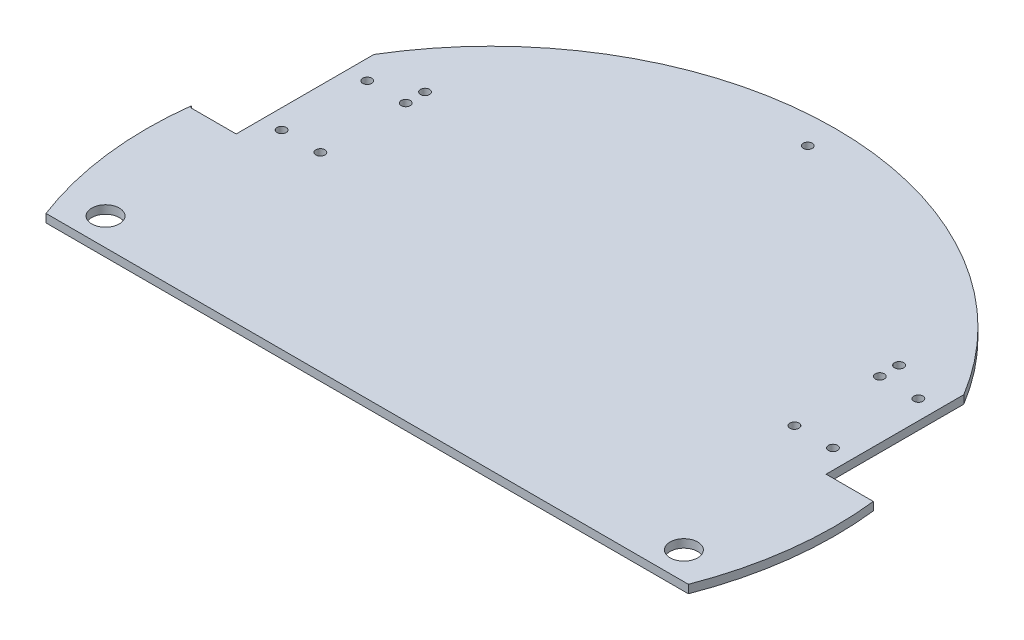
ISO-10303-21;
HEADER;
FILE_DESCRIPTION(('STEP AP214'),'2;1');
FILE_NAME('part.step','',(''),(''),'','','');
FILE_SCHEMA(('AUTOMOTIVE_DESIGN { 1 0 10303 214 1 1 1 1 }'));
ENDSEC;
DATA;
#1=APPLICATION_CONTEXT('core data for automotive mechanical design processes');
#2=APPLICATION_PROTOCOL_DEFINITION('international standard','automotive_design',2000,#1);
#3=PRODUCT_CONTEXT('',#1,'mechanical');
#4=PRODUCT('Part','Part','',(#3));
#5=PRODUCT_RELATED_PRODUCT_CATEGORY('part','',(#4));
#6=PRODUCT_DEFINITION_FORMATION('','',#4);
#7=PRODUCT_DEFINITION_CONTEXT('part definition',#1,'design');
#8=PRODUCT_DEFINITION('design','',#6,#7);
#9=PRODUCT_DEFINITION_SHAPE('','',#8);
#10=(LENGTH_UNIT() NAMED_UNIT(*) SI_UNIT(.MILLI.,.METRE.));
#11=(NAMED_UNIT(*) PLANE_ANGLE_UNIT() SI_UNIT($,.RADIAN.));
#12=(NAMED_UNIT(*) SI_UNIT($,.STERADIAN.) SOLID_ANGLE_UNIT());
#13=UNCERTAINTY_MEASURE_WITH_UNIT(LENGTH_MEASURE(1.E-05),#10,'distance_accuracy_value','');
#14=(GEOMETRIC_REPRESENTATION_CONTEXT(3) GLOBAL_UNCERTAINTY_ASSIGNED_CONTEXT((#13)) GLOBAL_UNIT_ASSIGNED_CONTEXT((#10,
#11,#12)) REPRESENTATION_CONTEXT('',''));
#15=CARTESIAN_POINT('',(0.,0.,0.));
#16=DIRECTION('',(0.,0.,1.));
#17=DIRECTION('',(1.,0.,0.));
#18=AXIS2_PLACEMENT_3D('',#15,#16,#17);
#19=CARTESIAN_POINT('',(-17.8076536899108,3.,0.854894606578442));
#20=DIRECTION('',(0.,-1.,0.));
#21=DIRECTION('',(0.,0.,-1.));
#22=AXIS2_PLACEMENT_3D('',#19,#20,#21);
#23=CYLINDRICAL_SURFACE('',#22,125.);
#24=CARTESIAN_POINT('',(-17.8076536899108,3.,0.854894606578442));
#25=DIRECTION('',(0.,1.,0.));
#26=DIRECTION('',(0.,0.,1.));
#27=AXIS2_PLACEMENT_3D('',#24,#25,#26);
#28=CIRCLE('',#27,125.);
#29=CARTESIAN_POINT('',(89.1923463100892,3.,-63.7670830790356));
#30=VERTEX_POINT('',#29);
#31=CARTESIAN_POINT('',(-124.881226526536,3.,-63.6451053934216));
#32=VERTEX_POINT('',#31);
#33=EDGE_CURVE('E41',#30,#32,#28,.T.);
#34=ORIENTED_EDGE('',*,*,#33,.F.);
#35=DIRECTION('',(0.,-1.,0.));
#36=VECTOR('',#35,1.);
#37=CARTESIAN_POINT('',(89.1923463100892,10.,-63.7670830790356));
#38=LINE('',#37,#36);
#39=CARTESIAN_POINT('',(89.1923463100892,0.,-63.7670830790356));
#40=VERTEX_POINT('',#39);
#41=EDGE_CURVE('E114',#30,#40,#38,.T.);
#42=ORIENTED_EDGE('',*,*,#41,.T.);
#43=CARTESIAN_POINT('',(-17.8076536899108,0.,0.854894606578442));
#44=DIRECTION('',(0.,1.,0.));
#45=DIRECTION('',(0.,0.,1.));
#46=AXIS2_PLACEMENT_3D('',#43,#44,#45);
#47=CIRCLE('',#46,125.);
#48=CARTESIAN_POINT('',(-124.881226526536,0.,-63.6451053934216));
#49=VERTEX_POINT('',#48);
#50=EDGE_CURVE('E57',#40,#49,#47,.T.);
#51=ORIENTED_EDGE('',*,*,#50,.T.);
#52=DIRECTION('',(0.,-1.,0.));
#53=VECTOR('',#52,1.);
#54=CARTESIAN_POINT('',(-124.881226526536,10.,-63.6451053934216));
#55=LINE('',#54,#53);
#56=EDGE_CURVE('E141',#32,#49,#55,.T.);
#57=ORIENTED_EDGE('',*,*,#56,.F.);
#58=EDGE_LOOP('',(#34,#42,#51,#57));
#59=FACE_BOUND('',#58,.T.);
#60=ADVANCED_FACE('F32',(#59),#23,.T.);
#61=CARTESIAN_POINT('',(-141.871934685686,3.,-14.4112175704417));
#62=VERTEX_POINT('',#61);
#63=CARTESIAN_POINT('',(-134.426691586817,3.,45.8548946065784));
#64=VERTEX_POINT('',#63);
#65=EDGE_CURVE('E42',#62,#64,#28,.T.);
#66=ORIENTED_EDGE('',*,*,#65,.F.);
#67=DIRECTION('',(0.,-1.,0.));
#68=VECTOR('',#67,1.);
#69=CARTESIAN_POINT('',(-141.871934685686,3.,-14.4112175704417));
#70=LINE('',#69,#68);
#71=CARTESIAN_POINT('',(-141.871934685686,0.,-14.4112175704417));
#72=VERTEX_POINT('',#71);
#73=EDGE_CURVE('E154',#62,#72,#70,.T.);
#74=ORIENTED_EDGE('',*,*,#73,.T.);
#75=CARTESIAN_POINT('',(-134.426691586817,0.,45.8548946065784));
#76=VERTEX_POINT('',#75);
#77=EDGE_CURVE('E226',#72,#76,#47,.T.);
#78=ORIENTED_EDGE('',*,*,#77,.T.);
#79=DIRECTION('',(0.,-1.,0.));
#80=VECTOR('',#79,1.);
#81=CARTESIAN_POINT('',(-134.426691586817,3.,45.8548946065784));
#82=LINE('',#81,#80);
#83=EDGE_CURVE('E221',#64,#76,#82,.T.);
#84=ORIENTED_EDGE('',*,*,#83,.F.);
#85=EDGE_LOOP('',(#66,#74,#78,#84));
#86=FACE_BOUND('',#85,.T.);
#87=ADVANCED_FACE('F238',(#86),#23,.T.);
#88=CARTESIAN_POINT('',(98.8113842069952,0.,45.8548946065784));
#89=VERTEX_POINT('',#88);
#90=CARTESIAN_POINT('',(106.334191666767,0.,-13.7670830790356));
#91=VERTEX_POINT('',#90);
#92=EDGE_CURVE('E36',#89,#91,#47,.T.);
#93=ORIENTED_EDGE('',*,*,#92,.T.);
#94=DIRECTION('',(0.,-1.,0.));
#95=VECTOR('',#94,1.);
#96=CARTESIAN_POINT('',(106.334191666767,10.,-13.7670830790356));
#97=LINE('',#96,#95);
#98=CARTESIAN_POINT('',(106.334191666767,3.,-13.7670830790356));
#99=VERTEX_POINT('',#98);
#100=EDGE_CURVE('E49',#99,#91,#97,.T.);
#101=ORIENTED_EDGE('',*,*,#100,.F.);
#102=CARTESIAN_POINT('',(98.8113842069952,3.,45.8548946065784));
#103=VERTEX_POINT('',#102);
#104=EDGE_CURVE('E11',#103,#99,#28,.T.);
#105=ORIENTED_EDGE('',*,*,#104,.F.);
#106=DIRECTION('',(0.,-1.,0.));
#107=VECTOR('',#106,1.);
#108=CARTESIAN_POINT('',(98.8113842069952,3.,45.8548946065784));
#109=LINE('',#108,#107);
#110=EDGE_CURVE('E223',#103,#89,#109,.T.);
#111=ORIENTED_EDGE('',*,*,#110,.T.);
#112=EDGE_LOOP('',(#93,#101,#105,#111));
#113=FACE_BOUND('',#112,.T.);
#114=ADVANCED_FACE('F34',(#113),#23,.T.);
#115=CARTESIAN_POINT('',(-17.8076536899108,3.,0.854894606578442));
#116=DIRECTION('',(0.,1.,0.));
#117=DIRECTION('',(0.,0.,1.));
#118=AXIS2_PLACEMENT_3D('',#115,#116,#117);
#119=PLANE('',#118);
#120=CARTESIAN_POINT('',(68.1923463100892,3.,-61.2670830790356));
#121=DIRECTION('',(0.,1.,0.));
#122=DIRECTION('',(0.,0.,1.));
#123=AXIS2_PLACEMENT_3D('',#120,#121,#122);
#124=CIRCLE('',#123,1.65);
#125=CARTESIAN_POINT('',(68.1923463100892,3.,-59.6170830790356));
#126=VERTEX_POINT('',#125);
#127=EDGE_CURVE('E473',#126,#126,#124,.T.);
#128=ORIENTED_EDGE('',*,*,#127,.F.);
#129=EDGE_LOOP('',(#128));
#130=FACE_BOUND('',#129,.T.);
#131=CARTESIAN_POINT('',(-17.3812265265356,3.,-113.706374405438));
#132=DIRECTION('',(0.,1.,0.));
#133=DIRECTION('',(0.,0.,1.));
#134=AXIS2_PLACEMENT_3D('',#131,#132,#133);
#135=CIRCLE('',#134,1.65);
#136=CARTESIAN_POINT('',(-17.3812265265356,3.,-112.056374405438));
#137=VERTEX_POINT('',#136);
#138=EDGE_CURVE('E483',#137,#137,#135,.T.);
#139=ORIENTED_EDGE('',*,*,#138,.F.);
#140=EDGE_LOOP('',(#139));
#141=FACE_BOUND('',#140,.T.);
#142=CARTESIAN_POINT('',(-103.807653689911,3.,-61.1451053934216));
#143=DIRECTION('',(0.,1.,0.));
#144=DIRECTION('',(0.,0.,1.));
#145=AXIS2_PLACEMENT_3D('',#142,#143,#144);
#146=CIRCLE('',#145,1.65);
#147=CARTESIAN_POINT('',(-103.807653689911,3.,-59.4951053934216));
#148=VERTEX_POINT('',#147);
#149=EDGE_CURVE('E121',#148,#148,#146,.T.);
#150=ORIENTED_EDGE('',*,*,#149,.F.);
#151=EDGE_LOOP('',(#150));
#152=FACE_BOUND('',#151,.T.);
#153=DIRECTION('',(0.,0.,1.));
#154=VECTOR('',#153,1.);
#155=CARTESIAN_POINT('',(89.1923463100892,3.,0.854894606578412));
#156=LINE('',#155,#154);
#157=CARTESIAN_POINT('',(89.1923463100892,3.,-13.7670830790356));
#158=VERTEX_POINT('',#157);
#159=EDGE_CURVE('E112',#30,#158,#156,.T.);
#160=ORIENTED_EDGE('',*,*,#159,.F.);
#161=ORIENTED_EDGE('',*,*,#33,.T.);
#162=DIRECTION('',(0.,0.,-1.));
#163=VECTOR('',#162,1.);
#164=CARTESIAN_POINT('',(-124.881226526536,3.,0.854894606578442));
#165=LINE('',#164,#163);
#166=CARTESIAN_POINT('',(-124.881226526536,3.,-13.6451053934216));
#167=VERTEX_POINT('',#166);
#168=EDGE_CURVE('E144',#167,#32,#165,.T.);
#169=ORIENTED_EDGE('',*,*,#168,.F.);
#170=DIRECTION('',(1.,0.,0.));
#171=VECTOR('',#170,1.);
#172=CARTESIAN_POINT('',(-17.8076536899108,3.,-13.6451053934216));
#173=LINE('',#172,#171);
#174=CARTESIAN_POINT('',(-141.357501756476,3.,-13.6451053934216));
#175=VERTEX_POINT('',#174);
#176=EDGE_CURVE('E150',#175,#167,#173,.T.);
#177=ORIENTED_EDGE('',*,*,#176,.F.);
#178=DIRECTION('',(0.557466547763257,0.,0.830199402628619));
#179=VECTOR('',#178,1.);
#180=CARTESIAN_POINT('',(-96.2513232418952,3.,53.5286516829715));
#181=LINE('',#180,#179);
#182=EDGE_CURVE('E152',#62,#175,#181,.T.);
#183=ORIENTED_EDGE('',*,*,#182,.F.);
#184=ORIENTED_EDGE('',*,*,#65,.T.);
#185=DIRECTION('',(1.,0.,0.));
#186=VECTOR('',#185,1.);
#187=CARTESIAN_POINT('',(0.,3.,45.8548946065784));
#188=LINE('',#187,#186);
#189=EDGE_CURVE('E218',#64,#103,#188,.T.);
#190=ORIENTED_EDGE('',*,*,#189,.T.);
#191=ORIENTED_EDGE('',*,*,#104,.T.);
#192=DIRECTION('',(1.,0.,0.));
#193=VECTOR('',#192,1.);
#194=CARTESIAN_POINT('',(-17.8076536899108,3.,-13.7670830790356));
#195=LINE('',#194,#193);
#196=EDGE_CURVE('E129',#158,#99,#195,.T.);
#197=ORIENTED_EDGE('',*,*,#196,.F.);
#198=EDGE_LOOP('',(#160,#161,#169,#177,#183,#184,#190,#191,#197));
#199=FACE_BOUND('',#198,.T.);
#200=CARTESIAN_POINT('',(87.1923463100892,3.,35.8548946065784));
#201=DIRECTION('',(0.,1.,0.));
#202=DIRECTION('',(0.,0.,1.));
#203=AXIS2_PLACEMENT_3D('',#200,#201,#202);
#204=CIRCLE('',#203,5.00000000000001);
#205=CARTESIAN_POINT('',(87.1923463100892,3.,40.8548946065784));
#206=VERTEX_POINT('',#205);
#207=EDGE_CURVE('E160',#206,#206,#204,.T.);
#208=ORIENTED_EDGE('',*,*,#207,.F.);
#209=EDGE_LOOP('',(#208));
#210=FACE_BOUND('',#209,.T.);
#211=CARTESIAN_POINT('',(-122.807653689911,3.,35.8548946065784));
#212=DIRECTION('',(0.,1.,0.));
#213=DIRECTION('',(0.,0.,1.));
#214=AXIS2_PLACEMENT_3D('',#211,#212,#213);
#215=CIRCLE('',#214,5.00000000000001);
#216=CARTESIAN_POINT('',(-122.807653689911,3.,40.8548946065784));
#217=VERTEX_POINT('',#216);
#218=EDGE_CURVE('E166',#217,#217,#215,.T.);
#219=ORIENTED_EDGE('',*,*,#218,.F.);
#220=EDGE_LOOP('',(#219));
#221=FACE_BOUND('',#220,.T.);
#222=CARTESIAN_POINT('',(68.1923463100892,3.,-23.2670830790356));
#223=DIRECTION('',(0.,1.,0.));
#224=DIRECTION('',(0.,0.,1.));
#225=AXIS2_PLACEMENT_3D('',#222,#223,#224);
#226=CIRCLE('',#225,1.65);
#227=CARTESIAN_POINT('',(68.1923463100892,3.,-21.6170830790356));
#228=VERTEX_POINT('',#227);
#229=EDGE_CURVE('E172',#228,#228,#226,.T.);
#230=ORIENTED_EDGE('',*,*,#229,.F.);
#231=EDGE_LOOP('',(#230));
#232=FACE_BOUND('',#231,.T.);
#233=CARTESIAN_POINT('',(82.1923463100892,3.,-23.2670830790356));
#234=DIRECTION('',(0.,1.,0.));
#235=DIRECTION('',(0.,0.,1.));
#236=AXIS2_PLACEMENT_3D('',#233,#234,#235);
#237=CIRCLE('',#236,1.65);
#238=CARTESIAN_POINT('',(82.1923463100892,3.,-21.6170830790356));
#239=VERTEX_POINT('',#238);
#240=EDGE_CURVE('E178',#239,#239,#237,.T.);
#241=ORIENTED_EDGE('',*,*,#240,.F.);
#242=EDGE_LOOP('',(#241));
#243=FACE_BOUND('',#242,.T.);
#244=CARTESIAN_POINT('',(82.1923463100892,3.,-54.2670830790356));
#245=DIRECTION('',(0.,1.,0.));
#246=DIRECTION('',(0.,0.,1.));
#247=AXIS2_PLACEMENT_3D('',#244,#245,#246);
#248=CIRCLE('',#247,1.65);
#249=CARTESIAN_POINT('',(82.1923463100892,3.,-52.6170830790356));
#250=VERTEX_POINT('',#249);
#251=EDGE_CURVE('E184',#250,#250,#248,.T.);
#252=ORIENTED_EDGE('',*,*,#251,.F.);
#253=EDGE_LOOP('',(#252));
#254=FACE_BOUND('',#253,.T.);
#255=CARTESIAN_POINT('',(68.1923463100892,3.,-54.2670830790356));
#256=DIRECTION('',(0.,1.,0.));
#257=DIRECTION('',(0.,0.,1.));
#258=AXIS2_PLACEMENT_3D('',#255,#256,#257);
#259=CIRCLE('',#258,1.65);
#260=CARTESIAN_POINT('',(68.1923463100892,3.,-52.6170830790356));
#261=VERTEX_POINT('',#260);
#262=EDGE_CURVE('E190',#261,#261,#259,.T.);
#263=ORIENTED_EDGE('',*,*,#262,.F.);
#264=EDGE_LOOP('',(#263));
#265=FACE_BOUND('',#264,.T.);
#266=CARTESIAN_POINT('',(-103.807653689911,3.,-23.1451053934216));
#267=DIRECTION('',(0.,1.,0.));
#268=DIRECTION('',(0.,0.,1.));
#269=AXIS2_PLACEMENT_3D('',#266,#267,#268);
#270=CIRCLE('',#269,1.65);
#271=CARTESIAN_POINT('',(-103.807653689911,3.,-21.4951053934216));
#272=VERTEX_POINT('',#271);
#273=EDGE_CURVE('E196',#272,#272,#270,.T.);
#274=ORIENTED_EDGE('',*,*,#273,.F.);
#275=EDGE_LOOP('',(#274));
#276=FACE_BOUND('',#275,.T.);
#277=CARTESIAN_POINT('',(-103.807653689911,3.,-54.1451053934216));
#278=DIRECTION('',(0.,1.,0.));
#279=DIRECTION('',(0.,0.,1.));
#280=AXIS2_PLACEMENT_3D('',#277,#278,#279);
#281=CIRCLE('',#280,1.65);
#282=CARTESIAN_POINT('',(-103.807653689911,3.,-52.4951053934216));
#283=VERTEX_POINT('',#282);
#284=EDGE_CURVE('E202',#283,#283,#281,.T.);
#285=ORIENTED_EDGE('',*,*,#284,.F.);
#286=EDGE_LOOP('',(#285));
#287=FACE_BOUND('',#286,.T.);
#288=CARTESIAN_POINT('',(-117.881226526536,3.,-23.1451926993879));
#289=DIRECTION('',(0.,1.,0.));
#290=DIRECTION('',(0.,0.,1.));
#291=AXIS2_PLACEMENT_3D('',#288,#289,#290);
#292=CIRCLE('',#291,1.65);
#293=CARTESIAN_POINT('',(-117.881226526536,3.,-21.4951926993879));
#294=VERTEX_POINT('',#293);
#295=EDGE_CURVE('E208',#294,#294,#292,.T.);
#296=ORIENTED_EDGE('',*,*,#295,.F.);
#297=EDGE_LOOP('',(#296));
#298=FACE_BOUND('',#297,.T.);
#299=CARTESIAN_POINT('',(-117.807653689911,3.,-54.1451053934216));
#300=DIRECTION('',(0.,1.,0.));
#301=DIRECTION('',(0.,0.,1.));
#302=AXIS2_PLACEMENT_3D('',#299,#300,#301);
#303=CIRCLE('',#302,1.65);
#304=CARTESIAN_POINT('',(-117.807653689911,3.,-52.4951053934216));
#305=VERTEX_POINT('',#304);
#306=EDGE_CURVE('E214',#305,#305,#303,.T.);
#307=ORIENTED_EDGE('',*,*,#306,.F.);
#308=EDGE_LOOP('',(#307));
#309=FACE_BOUND('',#308,.T.);
#310=ADVANCED_FACE('F245',(#130,#141,#152,#199,#210,#221,#232,#243,#254,#265,#276,#287,#298,
#309),#119,.T.);
#311=CARTESIAN_POINT('',(-17.8076536899108,0.,0.854894606578442));
#312=DIRECTION('',(0.,1.,0.));
#313=DIRECTION('',(0.,0.,1.));
#314=AXIS2_PLACEMENT_3D('',#311,#312,#313);
#315=PLANE('',#314);
#316=CARTESIAN_POINT('',(68.1923463100892,0.,-61.2670830790356));
#317=DIRECTION('',(0.,-1.,0.));
#318=DIRECTION('',(0.,0.,-1.));
#319=AXIS2_PLACEMENT_3D('',#316,#317,#318);
#320=CIRCLE('',#319,1.65);
#321=CARTESIAN_POINT('',(68.1923463100892,0.,-62.9170830790356));
#322=VERTEX_POINT('',#321);
#323=EDGE_CURVE('E476',#322,#322,#320,.T.);
#324=ORIENTED_EDGE('',*,*,#323,.F.);
#325=EDGE_LOOP('',(#324));
#326=FACE_BOUND('',#325,.T.);
#327=CARTESIAN_POINT('',(-17.3812265265356,0.,-113.706374405438));
#328=DIRECTION('',(0.,-1.,0.));
#329=DIRECTION('',(0.,0.,-1.));
#330=AXIS2_PLACEMENT_3D('',#327,#328,#329);
#331=CIRCLE('',#330,1.65);
#332=CARTESIAN_POINT('',(-17.3812265265356,0.,-115.356374405438));
#333=VERTEX_POINT('',#332);
#334=EDGE_CURVE('E478',#333,#333,#331,.T.);
#335=ORIENTED_EDGE('',*,*,#334,.F.);
#336=EDGE_LOOP('',(#335));
#337=FACE_BOUND('',#336,.T.);
#338=CARTESIAN_POINT('',(-103.807653689911,0.,-61.1451053934216));
#339=DIRECTION('',(0.,-1.,0.));
#340=DIRECTION('',(0.,0.,-1.));
#341=AXIS2_PLACEMENT_3D('',#338,#339,#340);
#342=CIRCLE('',#341,1.65);
#343=CARTESIAN_POINT('',(-103.807653689911,0.,-62.7951053934216));
#344=VERTEX_POINT('',#343);
#345=EDGE_CURVE('E486',#344,#344,#342,.T.);
#346=ORIENTED_EDGE('',*,*,#345,.F.);
#347=EDGE_LOOP('',(#346));
#348=FACE_BOUND('',#347,.T.);
#349=CARTESIAN_POINT('',(87.1923463100892,0.,35.8548946065784));
#350=DIRECTION('',(0.,-1.,0.));
#351=DIRECTION('',(0.,0.,-1.));
#352=AXIS2_PLACEMENT_3D('',#349,#350,#351);
#353=CIRCLE('',#352,5.00000000000001);
#354=CARTESIAN_POINT('',(87.1923463100892,0.,30.8548946065784));
#355=VERTEX_POINT('',#354);
#356=EDGE_CURVE('E157',#355,#355,#353,.T.);
#357=ORIENTED_EDGE('',*,*,#356,.F.);
#358=EDGE_LOOP('',(#357));
#359=FACE_BOUND('',#358,.T.);
#360=CARTESIAN_POINT('',(-122.807653689911,0.,35.8548946065784));
#361=DIRECTION('',(0.,-1.,0.));
#362=DIRECTION('',(0.,0.,-1.));
#363=AXIS2_PLACEMENT_3D('',#360,#361,#362);
#364=CIRCLE('',#363,5.00000000000001);
#365=CARTESIAN_POINT('',(-122.807653689911,0.,30.8548946065784));
#366=VERTEX_POINT('',#365);
#367=EDGE_CURVE('E163',#366,#366,#364,.T.);
#368=ORIENTED_EDGE('',*,*,#367,.F.);
#369=EDGE_LOOP('',(#368));
#370=FACE_BOUND('',#369,.T.);
#371=CARTESIAN_POINT('',(68.1923463100892,0.,-23.2670830790356));
#372=DIRECTION('',(0.,-1.,0.));
#373=DIRECTION('',(0.,0.,-1.));
#374=AXIS2_PLACEMENT_3D('',#371,#372,#373);
#375=CIRCLE('',#374,1.65);
#376=CARTESIAN_POINT('',(68.1923463100892,0.,-24.9170830790356));
#377=VERTEX_POINT('',#376);
#378=EDGE_CURVE('E169',#377,#377,#375,.T.);
#379=ORIENTED_EDGE('',*,*,#378,.F.);
#380=EDGE_LOOP('',(#379));
#381=FACE_BOUND('',#380,.T.);
#382=CARTESIAN_POINT('',(82.1923463100892,0.,-23.2670830790356));
#383=DIRECTION('',(0.,-1.,0.));
#384=DIRECTION('',(0.,0.,-1.));
#385=AXIS2_PLACEMENT_3D('',#382,#383,#384);
#386=CIRCLE('',#385,1.65);
#387=CARTESIAN_POINT('',(82.1923463100892,0.,-24.9170830790356));
#388=VERTEX_POINT('',#387);
#389=EDGE_CURVE('E175',#388,#388,#386,.T.);
#390=ORIENTED_EDGE('',*,*,#389,.F.);
#391=EDGE_LOOP('',(#390));
#392=FACE_BOUND('',#391,.T.);
#393=CARTESIAN_POINT('',(82.1923463100892,0.,-54.2670830790356));
#394=DIRECTION('',(0.,-1.,0.));
#395=DIRECTION('',(0.,0.,-1.));
#396=AXIS2_PLACEMENT_3D('',#393,#394,#395);
#397=CIRCLE('',#396,1.65);
#398=CARTESIAN_POINT('',(82.1923463100892,0.,-55.9170830790356));
#399=VERTEX_POINT('',#398);
#400=EDGE_CURVE('E181',#399,#399,#397,.T.);
#401=ORIENTED_EDGE('',*,*,#400,.F.);
#402=EDGE_LOOP('',(#401));
#403=FACE_BOUND('',#402,.T.);
#404=CARTESIAN_POINT('',(68.1923463100892,0.,-54.2670830790356));
#405=DIRECTION('',(0.,-1.,0.));
#406=DIRECTION('',(0.,0.,-1.));
#407=AXIS2_PLACEMENT_3D('',#404,#405,#406);
#408=CIRCLE('',#407,1.65);
#409=CARTESIAN_POINT('',(68.1923463100892,0.,-55.9170830790356));
#410=VERTEX_POINT('',#409);
#411=EDGE_CURVE('E187',#410,#410,#408,.T.);
#412=ORIENTED_EDGE('',*,*,#411,.F.);
#413=EDGE_LOOP('',(#412));
#414=FACE_BOUND('',#413,.T.);
#415=CARTESIAN_POINT('',(-103.807653689911,0.,-23.1451053934216));
#416=DIRECTION('',(0.,-1.,0.));
#417=DIRECTION('',(0.,0.,-1.));
#418=AXIS2_PLACEMENT_3D('',#415,#416,#417);
#419=CIRCLE('',#418,1.65);
#420=CARTESIAN_POINT('',(-103.807653689911,0.,-24.7951053934216));
#421=VERTEX_POINT('',#420);
#422=EDGE_CURVE('E193',#421,#421,#419,.T.);
#423=ORIENTED_EDGE('',*,*,#422,.F.);
#424=EDGE_LOOP('',(#423));
#425=FACE_BOUND('',#424,.T.);
#426=CARTESIAN_POINT('',(-103.807653689911,0.,-54.1451053934216));
#427=DIRECTION('',(0.,-1.,0.));
#428=DIRECTION('',(0.,0.,-1.));
#429=AXIS2_PLACEMENT_3D('',#426,#427,#428);
#430=CIRCLE('',#429,1.65);
#431=CARTESIAN_POINT('',(-103.807653689911,0.,-55.7951053934216));
#432=VERTEX_POINT('',#431);
#433=EDGE_CURVE('E199',#432,#432,#430,.T.);
#434=ORIENTED_EDGE('',*,*,#433,.F.);
#435=EDGE_LOOP('',(#434));
#436=FACE_BOUND('',#435,.T.);
#437=CARTESIAN_POINT('',(-117.881226526536,0.,-23.1451926993879));
#438=DIRECTION('',(0.,-1.,0.));
#439=DIRECTION('',(0.,0.,-1.));
#440=AXIS2_PLACEMENT_3D('',#437,#438,#439);
#441=CIRCLE('',#440,1.65);
#442=CARTESIAN_POINT('',(-117.881226526536,0.,-24.7951926993879));
#443=VERTEX_POINT('',#442);
#444=EDGE_CURVE('E205',#443,#443,#441,.T.);
#445=ORIENTED_EDGE('',*,*,#444,.F.);
#446=EDGE_LOOP('',(#445));
#447=FACE_BOUND('',#446,.T.);
#448=CARTESIAN_POINT('',(-117.807653689911,0.,-54.1451053934216));
#449=DIRECTION('',(0.,-1.,0.));
#450=DIRECTION('',(0.,0.,-1.));
#451=AXIS2_PLACEMENT_3D('',#448,#449,#450);
#452=CIRCLE('',#451,1.65);
#453=CARTESIAN_POINT('',(-117.807653689911,0.,-55.7951053934216));
#454=VERTEX_POINT('',#453);
#455=EDGE_CURVE('E211',#454,#454,#452,.T.);
#456=ORIENTED_EDGE('',*,*,#455,.F.);
#457=EDGE_LOOP('',(#456));
#458=FACE_BOUND('',#457,.T.);
#459=ORIENTED_EDGE('',*,*,#50,.F.);
#460=DIRECTION('',(0.,0.,-1.));
#461=VECTOR('',#460,1.);
#462=CARTESIAN_POINT('',(89.1923463100892,0.,-63.7670830790356));
#463=LINE('',#462,#461);
#464=CARTESIAN_POINT('',(89.1923463100892,0.,-13.7670830790356));
#465=VERTEX_POINT('',#464);
#466=EDGE_CURVE('E110',#465,#40,#463,.T.);
#467=ORIENTED_EDGE('',*,*,#466,.F.);
#468=DIRECTION('',(-1.,0.,0.));
#469=VECTOR('',#468,1.);
#470=CARTESIAN_POINT('',(89.1923463100892,0.,-13.7670830790356));
#471=LINE('',#470,#469);
#472=EDGE_CURVE('E116',#91,#465,#471,.T.);
#473=ORIENTED_EDGE('',*,*,#472,.F.);
#474=ORIENTED_EDGE('',*,*,#92,.F.);
#475=DIRECTION('',(1.,0.,0.));
#476=VECTOR('',#475,1.);
#477=CARTESIAN_POINT('',(0.,0.,45.8548946065784));
#478=LINE('',#477,#476);
#479=EDGE_CURVE('E217',#76,#89,#478,.T.);
#480=ORIENTED_EDGE('',*,*,#479,.F.);
#481=ORIENTED_EDGE('',*,*,#77,.F.);
#482=DIRECTION('',(-0.557466547763257,0.,-0.830199402628619));
#483=VECTOR('',#482,1.);
#484=CARTESIAN_POINT('',(-141.357501756476,0.,-13.6451053934216));
#485=LINE('',#484,#483);
#486=CARTESIAN_POINT('',(-141.357501756476,0.,-13.6451053934216));
#487=VERTEX_POINT('',#486);
#488=EDGE_CURVE('E139',#487,#72,#485,.T.);
#489=ORIENTED_EDGE('',*,*,#488,.F.);
#490=DIRECTION('',(-1.,0.,0.));
#491=VECTOR('',#490,1.);
#492=CARTESIAN_POINT('',(-124.881226526536,0.,-13.6451053934216));
#493=LINE('',#492,#491);
#494=CARTESIAN_POINT('',(-124.881226526536,0.,-13.6451053934216));
#495=VERTEX_POINT('',#494);
#496=EDGE_CURVE('E136',#495,#487,#493,.T.);
#497=ORIENTED_EDGE('',*,*,#496,.F.);
#498=DIRECTION('',(0.,0.,1.));
#499=VECTOR('',#498,1.);
#500=CARTESIAN_POINT('',(-124.881226526536,0.,-63.6451053934216));
#501=LINE('',#500,#499);
#502=EDGE_CURVE('E133',#49,#495,#501,.T.);
#503=ORIENTED_EDGE('',*,*,#502,.F.);
#504=EDGE_LOOP('',(#459,#467,#473,#474,#480,#481,#489,#497,#503));
#505=FACE_BOUND('',#504,.T.);
#506=ADVANCED_FACE('F123',(#326,#337,#348,#359,#370,#381,#392,#403,#414,#425,#436,#447,#458,
#505),#315,.F.);
#507=CARTESIAN_POINT('',(0.,3.,45.8548946065784));
#508=DIRECTION('',(0.,0.,-1.));
#509=DIRECTION('',(-1.,0.,0.));
#510=AXIS2_PLACEMENT_3D('',#507,#508,#509);
#511=PLANE('',#510);
#512=ORIENTED_EDGE('',*,*,#479,.T.);
#513=ORIENTED_EDGE('',*,*,#110,.F.);
#514=ORIENTED_EDGE('',*,*,#189,.F.);
#515=ORIENTED_EDGE('',*,*,#83,.T.);
#516=EDGE_LOOP('',(#512,#513,#514,#515));
#517=FACE_BOUND('',#516,.T.);
#518=ADVANCED_FACE('F232',(#517),#511,.F.);
#519=CARTESIAN_POINT('',(-117.807653689911,10.,-54.1451053934216));
#520=DIRECTION('',(0.,-1.,0.));
#521=DIRECTION('',(0.,0.,-1.));
#522=AXIS2_PLACEMENT_3D('',#519,#520,#521);
#523=CYLINDRICAL_SURFACE('',#522,1.65);
#524=ORIENTED_EDGE('',*,*,#306,.T.);
#525=EDGE_LOOP('',(#524));
#526=FACE_BOUND('',#525,.T.);
#527=ORIENTED_EDGE('',*,*,#455,.T.);
#528=EDGE_LOOP('',(#527));
#529=FACE_BOUND('',#528,.T.);
#530=ADVANCED_FACE('F282',(#526,#529),#523,.F.);
#531=CARTESIAN_POINT('',(-117.881226526536,10.,-23.1451926993879));
#532=DIRECTION('',(0.,-1.,0.));
#533=DIRECTION('',(0.,0.,-1.));
#534=AXIS2_PLACEMENT_3D('',#531,#532,#533);
#535=CYLINDRICAL_SURFACE('',#534,1.65);
#536=ORIENTED_EDGE('',*,*,#295,.T.);
#537=EDGE_LOOP('',(#536));
#538=FACE_BOUND('',#537,.T.);
#539=ORIENTED_EDGE('',*,*,#444,.T.);
#540=EDGE_LOOP('',(#539));
#541=FACE_BOUND('',#540,.T.);
#542=ADVANCED_FACE('F287',(#538,#541),#535,.F.);
#543=CARTESIAN_POINT('',(-103.807653689911,10.,-54.1451053934216));
#544=DIRECTION('',(0.,-1.,0.));
#545=DIRECTION('',(0.,0.,-1.));
#546=AXIS2_PLACEMENT_3D('',#543,#544,#545);
#547=CYLINDRICAL_SURFACE('',#546,1.65);
#548=ORIENTED_EDGE('',*,*,#284,.T.);
#549=EDGE_LOOP('',(#548));
#550=FACE_BOUND('',#549,.T.);
#551=ORIENTED_EDGE('',*,*,#433,.T.);
#552=EDGE_LOOP('',(#551));
#553=FACE_BOUND('',#552,.T.);
#554=ADVANCED_FACE('F298',(#550,#553),#547,.F.);
#555=CARTESIAN_POINT('',(-103.807653689911,10.,-23.1451053934216));
#556=DIRECTION('',(0.,-1.,0.));
#557=DIRECTION('',(0.,0.,-1.));
#558=AXIS2_PLACEMENT_3D('',#555,#556,#557);
#559=CYLINDRICAL_SURFACE('',#558,1.65);
#560=ORIENTED_EDGE('',*,*,#273,.T.);
#561=EDGE_LOOP('',(#560));
#562=FACE_BOUND('',#561,.T.);
#563=ORIENTED_EDGE('',*,*,#422,.T.);
#564=EDGE_LOOP('',(#563));
#565=FACE_BOUND('',#564,.T.);
#566=ADVANCED_FACE('F308',(#562,#565),#559,.F.);
#567=CARTESIAN_POINT('',(68.1923463100892,10.,-54.2670830790356));
#568=DIRECTION('',(0.,-1.,0.));
#569=DIRECTION('',(0.,0.,-1.));
#570=AXIS2_PLACEMENT_3D('',#567,#568,#569);
#571=CYLINDRICAL_SURFACE('',#570,1.65);
#572=ORIENTED_EDGE('',*,*,#262,.T.);
#573=EDGE_LOOP('',(#572));
#574=FACE_BOUND('',#573,.T.);
#575=ORIENTED_EDGE('',*,*,#411,.T.);
#576=EDGE_LOOP('',(#575));
#577=FACE_BOUND('',#576,.T.);
#578=ADVANCED_FACE('F318',(#574,#577),#571,.F.);
#579=CARTESIAN_POINT('',(82.1923463100892,10.,-54.2670830790356));
#580=DIRECTION('',(0.,-1.,0.));
#581=DIRECTION('',(0.,0.,-1.));
#582=AXIS2_PLACEMENT_3D('',#579,#580,#581);
#583=CYLINDRICAL_SURFACE('',#582,1.65);
#584=ORIENTED_EDGE('',*,*,#251,.T.);
#585=EDGE_LOOP('',(#584));
#586=FACE_BOUND('',#585,.T.);
#587=ORIENTED_EDGE('',*,*,#400,.T.);
#588=EDGE_LOOP('',(#587));
#589=FACE_BOUND('',#588,.T.);
#590=ADVANCED_FACE('F328',(#586,#589),#583,.F.);
#591=CARTESIAN_POINT('',(82.1923463100892,10.,-23.2670830790356));
#592=DIRECTION('',(0.,-1.,0.));
#593=DIRECTION('',(0.,0.,-1.));
#594=AXIS2_PLACEMENT_3D('',#591,#592,#593);
#595=CYLINDRICAL_SURFACE('',#594,1.65);
#596=ORIENTED_EDGE('',*,*,#240,.T.);
#597=EDGE_LOOP('',(#596));
#598=FACE_BOUND('',#597,.T.);
#599=ORIENTED_EDGE('',*,*,#389,.T.);
#600=EDGE_LOOP('',(#599));
#601=FACE_BOUND('',#600,.T.);
#602=ADVANCED_FACE('F338',(#598,#601),#595,.F.);
#603=CARTESIAN_POINT('',(68.1923463100892,10.,-23.2670830790356));
#604=DIRECTION('',(0.,-1.,0.));
#605=DIRECTION('',(0.,0.,-1.));
#606=AXIS2_PLACEMENT_3D('',#603,#604,#605);
#607=CYLINDRICAL_SURFACE('',#606,1.65);
#608=ORIENTED_EDGE('',*,*,#229,.T.);
#609=EDGE_LOOP('',(#608));
#610=FACE_BOUND('',#609,.T.);
#611=ORIENTED_EDGE('',*,*,#378,.T.);
#612=EDGE_LOOP('',(#611));
#613=FACE_BOUND('',#612,.T.);
#614=ADVANCED_FACE('F348',(#610,#613),#607,.F.);
#615=CARTESIAN_POINT('',(-122.807653689911,10.,35.8548946065784));
#616=DIRECTION('',(0.,-1.,0.));
#617=DIRECTION('',(0.,0.,-1.));
#618=AXIS2_PLACEMENT_3D('',#615,#616,#617);
#619=CYLINDRICAL_SURFACE('',#618,5.00000000000001);
#620=ORIENTED_EDGE('',*,*,#218,.T.);
#621=EDGE_LOOP('',(#620));
#622=FACE_BOUND('',#621,.T.);
#623=ORIENTED_EDGE('',*,*,#367,.T.);
#624=EDGE_LOOP('',(#623));
#625=FACE_BOUND('',#624,.T.);
#626=ADVANCED_FACE('F358',(#622,#625),#619,.F.);
#627=CARTESIAN_POINT('',(87.1923463100892,10.,35.8548946065784));
#628=DIRECTION('',(0.,-1.,0.));
#629=DIRECTION('',(0.,0.,-1.));
#630=AXIS2_PLACEMENT_3D('',#627,#628,#629);
#631=CYLINDRICAL_SURFACE('',#630,5.00000000000001);
#632=ORIENTED_EDGE('',*,*,#207,.T.);
#633=EDGE_LOOP('',(#632));
#634=FACE_BOUND('',#633,.T.);
#635=ORIENTED_EDGE('',*,*,#356,.T.);
#636=EDGE_LOOP('',(#635));
#637=FACE_BOUND('',#636,.T.);
#638=ADVANCED_FACE('F368',(#634,#637),#631,.F.);
#639=CARTESIAN_POINT('',(-141.357501756476,10.,-13.6451053934216));
#640=DIRECTION('',(-0.830199402628619,0.,0.557466547763257));
#641=DIRECTION('',(0.557466547763257,0.,0.830199402628619));
#642=AXIS2_PLACEMENT_3D('',#639,#640,#641);
#643=PLANE('',#642);
#644=ORIENTED_EDGE('',*,*,#182,.T.);
#645=DIRECTION('',(0.,-1.,0.));
#646=VECTOR('',#645,1.);
#647=CARTESIAN_POINT('',(-141.357501756476,10.,-13.6451053934216));
#648=LINE('',#647,#646);
#649=EDGE_CURVE('E142',#175,#487,#648,.T.);
#650=ORIENTED_EDGE('',*,*,#649,.T.);
#651=ORIENTED_EDGE('',*,*,#488,.T.);
#652=ORIENTED_EDGE('',*,*,#73,.F.);
#653=EDGE_LOOP('',(#644,#650,#651,#652));
#654=FACE_BOUND('',#653,.T.);
#655=ADVANCED_FACE('F241',(#654),#643,.F.);
#656=CARTESIAN_POINT('',(-124.881226526536,10.,-13.6451053934216));
#657=DIRECTION('',(0.,0.,1.));
#658=DIRECTION('',(1.,0.,0.));
#659=AXIS2_PLACEMENT_3D('',#656,#657,#658);
#660=PLANE('',#659);
#661=ORIENTED_EDGE('',*,*,#176,.T.);
#662=DIRECTION('',(0.,-1.,0.));
#663=VECTOR('',#662,1.);
#664=CARTESIAN_POINT('',(-124.881226526536,10.,-13.6451053934216));
#665=LINE('',#664,#663);
#666=EDGE_CURVE('E145',#167,#495,#665,.T.);
#667=ORIENTED_EDGE('',*,*,#666,.T.);
#668=ORIENTED_EDGE('',*,*,#496,.T.);
#669=ORIENTED_EDGE('',*,*,#649,.F.);
#670=EDGE_LOOP('',(#661,#667,#668,#669));
#671=FACE_BOUND('',#670,.T.);
#672=ADVANCED_FACE('F250',(#671),#660,.F.);
#673=CARTESIAN_POINT('',(-124.881226526536,10.,-63.6451053934216));
#674=DIRECTION('',(1.,0.,0.));
#675=DIRECTION('',(0.,0.,-1.));
#676=AXIS2_PLACEMENT_3D('',#673,#674,#675);
#677=PLANE('',#676);
#678=ORIENTED_EDGE('',*,*,#168,.T.);
#679=ORIENTED_EDGE('',*,*,#56,.T.);
#680=ORIENTED_EDGE('',*,*,#502,.T.);
#681=ORIENTED_EDGE('',*,*,#666,.F.);
#682=EDGE_LOOP('',(#678,#679,#680,#681));
#683=FACE_BOUND('',#682,.T.);
#684=ADVANCED_FACE('F252',(#683),#677,.F.);
#685=CARTESIAN_POINT('',(89.1923463100892,10.,-63.7670830790356));
#686=DIRECTION('',(-1.,0.,0.));
#687=DIRECTION('',(0.,0.,1.));
#688=AXIS2_PLACEMENT_3D('',#685,#686,#687);
#689=PLANE('',#688);
#690=ORIENTED_EDGE('',*,*,#159,.T.);
#691=DIRECTION('',(0.,-1.,0.));
#692=VECTOR('',#691,1.);
#693=CARTESIAN_POINT('',(89.1923463100892,10.,-13.7670830790356));
#694=LINE('',#693,#692);
#695=EDGE_CURVE('E107',#158,#465,#694,.T.);
#696=ORIENTED_EDGE('',*,*,#695,.T.);
#697=ORIENTED_EDGE('',*,*,#466,.T.);
#698=ORIENTED_EDGE('',*,*,#41,.F.);
#699=EDGE_LOOP('',(#690,#696,#697,#698));
#700=FACE_BOUND('',#699,.T.);
#701=ADVANCED_FACE('F108',(#700),#689,.F.);
#702=CARTESIAN_POINT('',(89.1923463100892,10.,-13.7670830790356));
#703=DIRECTION('',(0.,0.,1.));
#704=DIRECTION('',(1.,0.,0.));
#705=AXIS2_PLACEMENT_3D('',#702,#703,#704);
#706=PLANE('',#705);
#707=ORIENTED_EDGE('',*,*,#196,.T.);
#708=ORIENTED_EDGE('',*,*,#100,.T.);
#709=ORIENTED_EDGE('',*,*,#472,.T.);
#710=ORIENTED_EDGE('',*,*,#695,.F.);
#711=EDGE_LOOP('',(#707,#708,#709,#710));
#712=FACE_BOUND('',#711,.T.);
#713=ADVANCED_FACE('F117',(#712),#706,.F.);
#714=CARTESIAN_POINT('',(-103.807653689911,100.,-61.1451053934216));
#715=DIRECTION('',(0.,-1.,0.));
#716=DIRECTION('',(0.,0.,-1.));
#717=AXIS2_PLACEMENT_3D('',#714,#715,#716);
#718=CYLINDRICAL_SURFACE('',#717,1.65);
#719=ORIENTED_EDGE('',*,*,#149,.T.);
#720=EDGE_LOOP('',(#719));
#721=FACE_BOUND('',#720,.T.);
#722=ORIENTED_EDGE('',*,*,#345,.T.);
#723=EDGE_LOOP('',(#722));
#724=FACE_BOUND('',#723,.T.);
#725=ADVANCED_FACE('F419',(#721,#724),#718,.F.);
#726=CARTESIAN_POINT('',(-17.3812265265356,100.,-113.706374405438));
#727=DIRECTION('',(0.,-1.,0.));
#728=DIRECTION('',(0.,0.,-1.));
#729=AXIS2_PLACEMENT_3D('',#726,#727,#728);
#730=CYLINDRICAL_SURFACE('',#729,1.65);
#731=ORIENTED_EDGE('',*,*,#138,.T.);
#732=EDGE_LOOP('',(#731));
#733=FACE_BOUND('',#732,.T.);
#734=ORIENTED_EDGE('',*,*,#334,.T.);
#735=EDGE_LOOP('',(#734));
#736=FACE_BOUND('',#735,.T.);
#737=ADVANCED_FACE('F441',(#733,#736),#730,.F.);
#738=CARTESIAN_POINT('',(68.1923463100892,100.,-61.2670830790356));
#739=DIRECTION('',(0.,-1.,0.));
#740=DIRECTION('',(0.,0.,-1.));
#741=AXIS2_PLACEMENT_3D('',#738,#739,#740);
#742=CYLINDRICAL_SURFACE('',#741,1.65);
#743=ORIENTED_EDGE('',*,*,#127,.T.);
#744=EDGE_LOOP('',(#743));
#745=FACE_BOUND('',#744,.T.);
#746=ORIENTED_EDGE('',*,*,#323,.T.);
#747=EDGE_LOOP('',(#746));
#748=FACE_BOUND('',#747,.T.);
#749=ADVANCED_FACE('F451',(#745,#748),#742,.F.);
#750=CLOSED_SHELL('',(#60,#87,#114,#310,#506,#518,#530,#542,#554,#566,#578,#590,#602,#614,#626,
#638,#655,#672,#684,#701,#713,#725,#737,#749));
#751=MANIFOLD_SOLID_BREP('B2',#750);
#752=ADVANCED_BREP_SHAPE_REPRESENTATION('',(#18,#751),#14);
#753=SHAPE_DEFINITION_REPRESENTATION(#9,#752);
ENDSEC;
END-ISO-10303-21;
